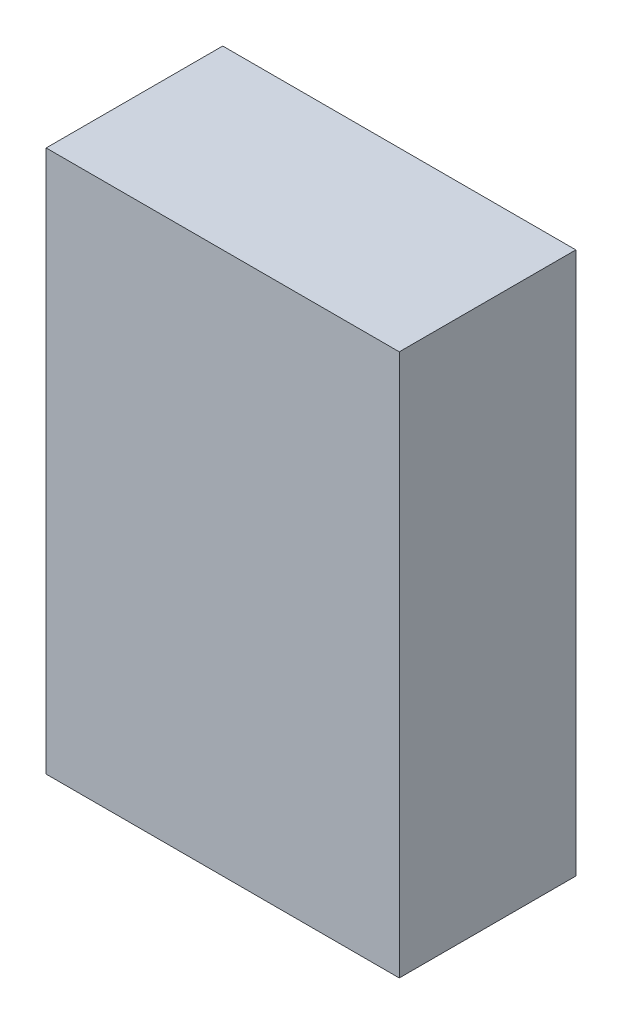
ISO-10303-21;
HEADER;
FILE_DESCRIPTION(('STEP AP214'),'2;1');
FILE_NAME('part.step','',(''),(''),'','','');
FILE_SCHEMA(('AUTOMOTIVE_DESIGN { 1 0 10303 214 1 1 1 1 }'));
ENDSEC;
DATA;
#1=APPLICATION_CONTEXT('core data for automotive mechanical design processes');
#2=APPLICATION_PROTOCOL_DEFINITION('international standard','automotive_design',2000,#1);
#3=PRODUCT_CONTEXT('',#1,'mechanical');
#4=PRODUCT('Part','Part','',(#3));
#5=PRODUCT_RELATED_PRODUCT_CATEGORY('part','',(#4));
#6=PRODUCT_DEFINITION_FORMATION('','',#4);
#7=PRODUCT_DEFINITION_CONTEXT('part definition',#1,'design');
#8=PRODUCT_DEFINITION('design','',#6,#7);
#9=PRODUCT_DEFINITION_SHAPE('','',#8);
#10=(LENGTH_UNIT() NAMED_UNIT(*) SI_UNIT(.MILLI.,.METRE.));
#11=(NAMED_UNIT(*) PLANE_ANGLE_UNIT() SI_UNIT($,.RADIAN.));
#12=(NAMED_UNIT(*) SI_UNIT($,.STERADIAN.) SOLID_ANGLE_UNIT());
#13=UNCERTAINTY_MEASURE_WITH_UNIT(LENGTH_MEASURE(1.E-05),#10,'distance_accuracy_value','');
#14=(GEOMETRIC_REPRESENTATION_CONTEXT(3) GLOBAL_UNCERTAINTY_ASSIGNED_CONTEXT((#13)) GLOBAL_UNIT_ASSIGNED_CONTEXT((#10,
#11,#12)) REPRESENTATION_CONTEXT('',''));
#15=CARTESIAN_POINT('',(0.,0.,0.));
#16=DIRECTION('',(0.,0.,1.));
#17=DIRECTION('',(1.,0.,0.));
#18=AXIS2_PLACEMENT_3D('',#15,#16,#17);
#19=CARTESIAN_POINT('',(-0.70000114,1.07499912,0.));
#20=DIRECTION('',(1.,0.,0.));
#21=DIRECTION('',(0.,-1.,0.));
#22=AXIS2_PLACEMENT_3D('',#19,#20,#21);
#23=PLANE('',#22);
#24=DIRECTION('',(0.,-1.,0.));
#25=VECTOR('',#24,1.);
#26=CARTESIAN_POINT('',(-0.70000114,1.07499912,0.));
#27=LINE('',#26,#25);
#28=CARTESIAN_POINT('',(-0.70000114,1.07499912,0.));
#29=VERTEX_POINT('',#28);
#30=CARTESIAN_POINT('',(-0.70000114,-1.07499912,0.));
#31=VERTEX_POINT('',#30);
#32=EDGE_CURVE('E11',#29,#31,#27,.T.);
#33=ORIENTED_EDGE('',*,*,#32,.T.);
#34=DIRECTION('',(0.,0.,1.));
#35=VECTOR('',#34,1.);
#36=CARTESIAN_POINT('',(-0.70000114,-1.07499912,0.));
#37=LINE('',#36,#35);
#38=CARTESIAN_POINT('',(-0.70000114,-1.07499912,0.70000114));
#39=VERTEX_POINT('',#38);
#40=EDGE_CURVE('E23',#31,#39,#37,.T.);
#41=ORIENTED_EDGE('',*,*,#40,.T.);
#42=DIRECTION('',(0.,-1.,0.));
#43=VECTOR('',#42,1.);
#44=CARTESIAN_POINT('',(-0.70000114,1.07499912,0.70000114));
#45=LINE('',#44,#43);
#46=CARTESIAN_POINT('',(-0.70000114,1.07499912,0.70000114));
#47=VERTEX_POINT('',#46);
#48=EDGE_CURVE('E86',#47,#39,#45,.T.);
#49=ORIENTED_EDGE('',*,*,#48,.F.);
#50=DIRECTION('',(0.,0.,1.));
#51=VECTOR('',#50,1.);
#52=CARTESIAN_POINT('',(-0.70000114,1.07499912,0.));
#53=LINE('',#52,#51);
#54=EDGE_CURVE('E35',#29,#47,#53,.T.);
#55=ORIENTED_EDGE('',*,*,#54,.F.);
#56=EDGE_LOOP('',(#33,#41,#49,#55));
#57=FACE_BOUND('',#56,.T.);
#58=ADVANCED_FACE('F16',(#57),#23,.F.);
#59=CARTESIAN_POINT('',(-0.70000114,-1.07499912,0.));
#60=DIRECTION('',(0.,1.,0.));
#61=DIRECTION('',(1.,0.,0.));
#62=AXIS2_PLACEMENT_3D('',#59,#60,#61);
#63=PLANE('',#62);
#64=DIRECTION('',(1.,0.,0.));
#65=VECTOR('',#64,1.);
#66=CARTESIAN_POINT('',(-0.70000114,-1.07499912,0.));
#67=LINE('',#66,#65);
#68=CARTESIAN_POINT('',(0.70000114,-1.07499912,0.));
#69=VERTEX_POINT('',#68);
#70=EDGE_CURVE('E83',#31,#69,#67,.T.);
#71=ORIENTED_EDGE('',*,*,#70,.T.);
#72=DIRECTION('',(0.,0.,1.));
#73=VECTOR('',#72,1.);
#74=CARTESIAN_POINT('',(0.70000114,-1.07499912,0.));
#75=LINE('',#74,#73);
#76=CARTESIAN_POINT('',(0.70000114,-1.07499912,0.70000114));
#77=VERTEX_POINT('',#76);
#78=EDGE_CURVE('E81',#69,#77,#75,.T.);
#79=ORIENTED_EDGE('',*,*,#78,.T.);
#80=DIRECTION('',(1.,0.,0.));
#81=VECTOR('',#80,1.);
#82=CARTESIAN_POINT('',(-0.70000114,-1.07499912,0.70000114));
#83=LINE('',#82,#81);
#84=EDGE_CURVE('E61',#39,#77,#83,.T.);
#85=ORIENTED_EDGE('',*,*,#84,.F.);
#86=ORIENTED_EDGE('',*,*,#40,.F.);
#87=EDGE_LOOP('',(#71,#79,#85,#86));
#88=FACE_BOUND('',#87,.T.);
#89=ADVANCED_FACE('F88',(#88),#63,.F.);
#90=CARTESIAN_POINT('',(0.70000114,-1.07499912,0.));
#91=DIRECTION('',(-1.,0.,0.));
#92=DIRECTION('',(0.,1.,0.));
#93=AXIS2_PLACEMENT_3D('',#90,#91,#92);
#94=PLANE('',#93);
#95=DIRECTION('',(0.,1.,0.));
#96=VECTOR('',#95,1.);
#97=CARTESIAN_POINT('',(0.70000114,-1.07499912,0.));
#98=LINE('',#97,#96);
#99=CARTESIAN_POINT('',(0.70000114,1.07499912,0.));
#100=VERTEX_POINT('',#99);
#101=EDGE_CURVE('E70',#69,#100,#98,.T.);
#102=ORIENTED_EDGE('',*,*,#101,.T.);
#103=DIRECTION('',(0.,0.,1.));
#104=VECTOR('',#103,1.);
#105=CARTESIAN_POINT('',(0.70000114,1.07499912,0.));
#106=LINE('',#105,#104);
#107=CARTESIAN_POINT('',(0.70000114,1.07499912,0.70000114));
#108=VERTEX_POINT('',#107);
#109=EDGE_CURVE('E64',#100,#108,#106,.T.);
#110=ORIENTED_EDGE('',*,*,#109,.T.);
#111=DIRECTION('',(0.,1.,0.));
#112=VECTOR('',#111,1.);
#113=CARTESIAN_POINT('',(0.70000114,-1.07499912,0.70000114));
#114=LINE('',#113,#112);
#115=EDGE_CURVE('E56',#77,#108,#114,.T.);
#116=ORIENTED_EDGE('',*,*,#115,.F.);
#117=ORIENTED_EDGE('',*,*,#78,.F.);
#118=EDGE_LOOP('',(#102,#110,#116,#117));
#119=FACE_BOUND('',#118,.T.);
#120=ADVANCED_FACE('F68',(#119),#94,.F.);
#121=CARTESIAN_POINT('',(0.70000114,1.07499912,0.));
#122=DIRECTION('',(0.,-1.,0.));
#123=DIRECTION('',(-1.,0.,0.));
#124=AXIS2_PLACEMENT_3D('',#121,#122,#123);
#125=PLANE('',#124);
#126=DIRECTION('',(-1.,0.,0.));
#127=VECTOR('',#126,1.);
#128=CARTESIAN_POINT('',(0.70000114,1.07499912,0.));
#129=LINE('',#128,#127);
#130=EDGE_CURVE('E65',#100,#29,#129,.T.);
#131=ORIENTED_EDGE('',*,*,#130,.T.);
#132=ORIENTED_EDGE('',*,*,#54,.T.);
#133=DIRECTION('',(-1.,0.,0.));
#134=VECTOR('',#133,1.);
#135=CARTESIAN_POINT('',(0.70000114,1.07499912,0.70000114));
#136=LINE('',#135,#134);
#137=EDGE_CURVE('E60',#108,#47,#136,.T.);
#138=ORIENTED_EDGE('',*,*,#137,.F.);
#139=ORIENTED_EDGE('',*,*,#109,.F.);
#140=EDGE_LOOP('',(#131,#132,#138,#139));
#141=FACE_BOUND('',#140,.T.);
#142=ADVANCED_FACE('F75',(#141),#125,.F.);
#143=CARTESIAN_POINT('',(-0.70000114,1.07499912,0.));
#144=DIRECTION('',(0.,0.,-1.));
#145=DIRECTION('',(-1.,0.,0.));
#146=AXIS2_PLACEMENT_3D('',#143,#144,#145);
#147=PLANE('',#146);
#148=ORIENTED_EDGE('',*,*,#130,.F.);
#149=ORIENTED_EDGE('',*,*,#101,.F.);
#150=ORIENTED_EDGE('',*,*,#70,.F.);
#151=ORIENTED_EDGE('',*,*,#32,.F.);
#152=EDGE_LOOP('',(#148,#149,#150,#151));
#153=FACE_BOUND('',#152,.T.);
#154=ADVANCED_FACE('F90',(#153),#147,.T.);
#155=CARTESIAN_POINT('',(-0.70000114,1.07499912,0.70000114));
#156=DIRECTION('',(0.,0.,-1.));
#157=DIRECTION('',(-1.,0.,0.));
#158=AXIS2_PLACEMENT_3D('',#155,#156,#157);
#159=PLANE('',#158);
#160=ORIENTED_EDGE('',*,*,#48,.T.);
#161=ORIENTED_EDGE('',*,*,#84,.T.);
#162=ORIENTED_EDGE('',*,*,#115,.T.);
#163=ORIENTED_EDGE('',*,*,#137,.T.);
#164=EDGE_LOOP('',(#160,#161,#162,#163));
#165=FACE_BOUND('',#164,.T.);
#166=ADVANCED_FACE('F58',(#165),#159,.F.);
#167=CLOSED_SHELL('',(#58,#89,#120,#142,#154,#166));
#168=MANIFOLD_SOLID_BREP('B1',#167);
#169=ADVANCED_BREP_SHAPE_REPRESENTATION('',(#18,#168),#14);
#170=SHAPE_DEFINITION_REPRESENTATION(#9,#169);
ENDSEC;
END-ISO-10303-21;
